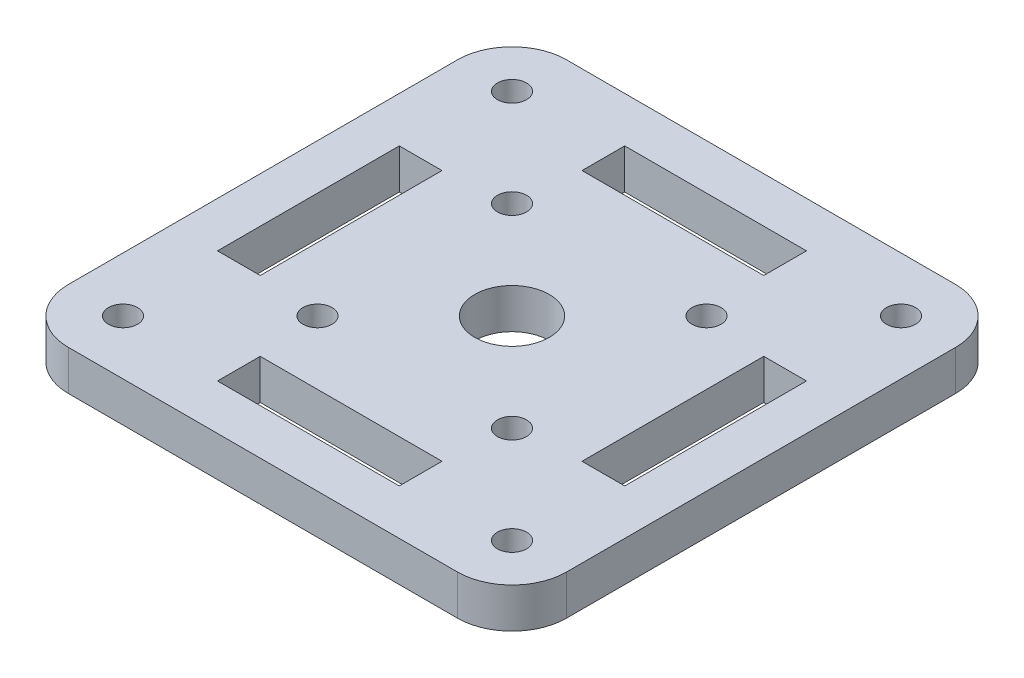
ISO-10303-21;
HEADER;
FILE_DESCRIPTION(('STEP AP214'),'2;1');
FILE_NAME('part.step','',(''),(''),'','','');
FILE_SCHEMA(('AUTOMOTIVE_DESIGN { 1 0 10303 214 1 1 1 1 }'));
ENDSEC;
DATA;
#1=APPLICATION_CONTEXT('core data for automotive mechanical design processes');
#2=APPLICATION_PROTOCOL_DEFINITION('international standard','automotive_design',2000,#1);
#3=PRODUCT_CONTEXT('',#1,'mechanical');
#4=PRODUCT('Part','Part','',(#3));
#5=PRODUCT_RELATED_PRODUCT_CATEGORY('part','',(#4));
#6=PRODUCT_DEFINITION_FORMATION('','',#4);
#7=PRODUCT_DEFINITION_CONTEXT('part definition',#1,'design');
#8=PRODUCT_DEFINITION('design','',#6,#7);
#9=PRODUCT_DEFINITION_SHAPE('','',#8);
#10=(LENGTH_UNIT() NAMED_UNIT(*) SI_UNIT(.MILLI.,.METRE.));
#11=(NAMED_UNIT(*) PLANE_ANGLE_UNIT() SI_UNIT($,.RADIAN.));
#12=(NAMED_UNIT(*) SI_UNIT($,.STERADIAN.) SOLID_ANGLE_UNIT());
#13=UNCERTAINTY_MEASURE_WITH_UNIT(LENGTH_MEASURE(1.E-05),#10,'distance_accuracy_value','');
#14=(GEOMETRIC_REPRESENTATION_CONTEXT(3) GLOBAL_UNCERTAINTY_ASSIGNED_CONTEXT((#13)) GLOBAL_UNIT_ASSIGNED_CONTEXT((#10,
#11,#12)) REPRESENTATION_CONTEXT('',''));
#15=CARTESIAN_POINT('',(0.,0.,0.));
#16=DIRECTION('',(0.,0.,1.));
#17=DIRECTION('',(1.,0.,0.));
#18=AXIS2_PLACEMENT_3D('',#15,#16,#17);
#19=CARTESIAN_POINT('',(0.,4.4,0.));
#20=DIRECTION('',(0.,1.,0.));
#21=DIRECTION('',(0.,0.,1.));
#22=AXIS2_PLACEMENT_3D('',#19,#20,#21);
#23=PLANE('',#22);
#24=CARTESIAN_POINT('',(10.7000000000006,4.4,10.7));
#25=DIRECTION('',(0.,1.,0.));
#26=DIRECTION('',(0.,0.,1.));
#27=AXIS2_PLACEMENT_3D('',#24,#25,#26);
#28=CIRCLE('',#27,1.59999999999985);
#29=CARTESIAN_POINT('',(10.7000000000006,4.4,12.2999999999999));
#30=VERTEX_POINT('',#29);
#31=EDGE_CURVE('E425',#30,#30,#28,.T.);
#32=ORIENTED_EDGE('',*,*,#31,.F.);
#33=EDGE_LOOP('',(#32));
#34=FACE_BOUND('',#33,.T.);
#35=CARTESIAN_POINT('',(-10.6999999999994,4.4,10.7000000000006));
#36=DIRECTION('',(0.,1.,0.));
#37=DIRECTION('',(0.,0.,1.));
#38=AXIS2_PLACEMENT_3D('',#35,#36,#37);
#39=CIRCLE('',#38,1.60000000000044);
#40=CARTESIAN_POINT('',(-10.6999999999994,4.4,12.3000000000011));
#41=VERTEX_POINT('',#40);
#42=EDGE_CURVE('E439',#41,#41,#39,.T.);
#43=ORIENTED_EDGE('',*,*,#42,.F.);
#44=EDGE_LOOP('',(#43));
#45=FACE_BOUND('',#44,.T.);
#46=CARTESIAN_POINT('',(-10.7,4.4,-10.6999999999994));
#47=DIRECTION('',(0.,1.,0.));
#48=DIRECTION('',(0.,0.,1.));
#49=AXIS2_PLACEMENT_3D('',#46,#47,#48);
#50=CIRCLE('',#49,1.60000000000064);
#51=CARTESIAN_POINT('',(-10.7,4.4,-9.09999999999877));
#52=VERTEX_POINT('',#51);
#53=EDGE_CURVE('E436',#52,#52,#50,.T.);
#54=ORIENTED_EDGE('',*,*,#53,.F.);
#55=EDGE_LOOP('',(#54));
#56=FACE_BOUND('',#55,.T.);
#57=CARTESIAN_POINT('',(10.7,4.4,-10.7));
#58=DIRECTION('',(0.,1.,0.));
#59=DIRECTION('',(0.,0.,1.));
#60=AXIS2_PLACEMENT_3D('',#57,#58,#59);
#61=CIRCLE('',#60,1.6);
#62=CARTESIAN_POINT('',(10.7,4.4,-9.10000000000004));
#63=VERTEX_POINT('',#62);
#64=EDGE_CURVE('E421',#63,#63,#61,.T.);
#65=ORIENTED_EDGE('',*,*,#64,.F.);
#66=EDGE_LOOP('',(#65));
#67=FACE_BOUND('',#66,.T.);
#68=CARTESIAN_POINT('',(-21.4,4.4,21.4000000000001));
#69=DIRECTION('',(0.,1.,0.));
#70=DIRECTION('',(0.,0.,1.));
#71=AXIS2_PLACEMENT_3D('',#68,#69,#70);
#72=CIRCLE('',#71,1.6);
#73=CARTESIAN_POINT('',(-21.4,4.4,23.0000000000001));
#74=VERTEX_POINT('',#73);
#75=EDGE_CURVE('E281',#74,#74,#72,.T.);
#76=ORIENTED_EDGE('',*,*,#75,.F.);
#77=EDGE_LOOP('',(#76));
#78=FACE_BOUND('',#77,.T.);
#79=CARTESIAN_POINT('',(21.4,4.4,-21.4000000000001));
#80=DIRECTION('',(0.,1.,0.));
#81=DIRECTION('',(0.,0.,1.));
#82=AXIS2_PLACEMENT_3D('',#79,#80,#81);
#83=CIRCLE('',#82,1.60000000000002);
#84=CARTESIAN_POINT('',(21.4,4.4,-19.8000000000001));
#85=VERTEX_POINT('',#84);
#86=EDGE_CURVE('E324',#85,#85,#83,.T.);
#87=ORIENTED_EDGE('',*,*,#86,.F.);
#88=EDGE_LOOP('',(#87));
#89=FACE_BOUND('',#88,.T.);
#90=DIRECTION('',(0.,0.,1.));
#91=VECTOR('',#90,1.);
#92=CARTESIAN_POINT('',(-27.4,4.4,-27.4000000000001));
#93=LINE('',#92,#91);
#94=CARTESIAN_POINT('',(-27.4,4.4,-21.4000000000001));
#95=VERTEX_POINT('',#94);
#96=CARTESIAN_POINT('',(-27.4,4.4,21.4000000000001));
#97=VERTEX_POINT('',#96);
#98=EDGE_CURVE('E373',#95,#97,#93,.T.);
#99=ORIENTED_EDGE('',*,*,#98,.T.);
#100=CARTESIAN_POINT('',(-21.4,4.4,21.4000000000001));
#101=DIRECTION('',(0.,1.,0.));
#102=DIRECTION('',(0.,0.,1.));
#103=AXIS2_PLACEMENT_3D('',#100,#101,#102);
#104=CIRCLE('',#103,6.);
#105=CARTESIAN_POINT('',(-21.4,4.4,27.4000000000001));
#106=VERTEX_POINT('',#105);
#107=EDGE_CURVE('E411',#97,#106,#104,.T.);
#108=ORIENTED_EDGE('',*,*,#107,.T.);
#109=DIRECTION('',(1.,0.,0.));
#110=VECTOR('',#109,1.);
#111=CARTESIAN_POINT('',(-27.4,4.4,27.4000000000001));
#112=LINE('',#111,#110);
#113=CARTESIAN_POINT('',(21.4,4.4,27.4000000000001));
#114=VERTEX_POINT('',#113);
#115=EDGE_CURVE('E376',#106,#114,#112,.T.);
#116=ORIENTED_EDGE('',*,*,#115,.T.);
#117=CARTESIAN_POINT('',(21.4,4.4,21.4000000000001));
#118=DIRECTION('',(0.,1.,0.));
#119=DIRECTION('',(0.,0.,1.));
#120=AXIS2_PLACEMENT_3D('',#117,#118,#119);
#121=CIRCLE('',#120,6.);
#122=CARTESIAN_POINT('',(27.4,4.4,21.4000000000001));
#123=VERTEX_POINT('',#122);
#124=EDGE_CURVE('E406',#114,#123,#121,.T.);
#125=ORIENTED_EDGE('',*,*,#124,.T.);
#126=DIRECTION('',(0.,0.,-1.));
#127=VECTOR('',#126,1.);
#128=CARTESIAN_POINT('',(27.4,4.4,-27.4000000000001));
#129=LINE('',#128,#127);
#130=CARTESIAN_POINT('',(27.4,4.4,-21.4000000000001));
#131=VERTEX_POINT('',#130);
#132=EDGE_CURVE('E368',#123,#131,#129,.T.);
#133=ORIENTED_EDGE('',*,*,#132,.T.);
#134=CARTESIAN_POINT('',(21.4,4.4,-21.4000000000001));
#135=DIRECTION('',(0.,1.,0.));
#136=DIRECTION('',(0.,0.,1.));
#137=AXIS2_PLACEMENT_3D('',#134,#135,#136);
#138=CIRCLE('',#137,6.);
#139=CARTESIAN_POINT('',(21.4,4.4,-27.4000000000001));
#140=VERTEX_POINT('',#139);
#141=EDGE_CURVE('E59',#131,#140,#138,.T.);
#142=ORIENTED_EDGE('',*,*,#141,.T.);
#143=DIRECTION('',(-1.,0.,0.));
#144=VECTOR('',#143,1.);
#145=CARTESIAN_POINT('',(-27.4,4.4,-27.4000000000001));
#146=LINE('',#145,#144);
#147=CARTESIAN_POINT('',(-21.4,4.4,-27.4000000000001));
#148=VERTEX_POINT('',#147);
#149=EDGE_CURVE('E370',#140,#148,#146,.T.);
#150=ORIENTED_EDGE('',*,*,#149,.T.);
#151=CARTESIAN_POINT('',(-21.4,4.4,-21.4000000000001));
#152=DIRECTION('',(0.,1.,0.));
#153=DIRECTION('',(0.,0.,1.));
#154=AXIS2_PLACEMENT_3D('',#151,#152,#153);
#155=CIRCLE('',#154,6.);
#156=EDGE_CURVE('E409',#148,#95,#155,.T.);
#157=ORIENTED_EDGE('',*,*,#156,.T.);
#158=EDGE_LOOP('',(#99,#108,#116,#125,#133,#142,#150,#157));
#159=FACE_BOUND('',#158,.T.);
#160=CARTESIAN_POINT('',(0.,4.4,0.));
#161=DIRECTION('',(0.,1.,0.));
#162=DIRECTION('',(0.,0.,1.));
#163=AXIS2_PLACEMENT_3D('',#160,#161,#162);
#164=CIRCLE('',#163,4.1);
#165=CARTESIAN_POINT('',(0.,4.4,4.1));
#166=VERTEX_POINT('',#165);
#167=EDGE_CURVE('E362',#166,#166,#164,.T.);
#168=ORIENTED_EDGE('',*,*,#167,.F.);
#169=EDGE_LOOP('',(#168));
#170=FACE_BOUND('',#169,.T.);
#171=DIRECTION('',(0.,0.,-1.));
#172=VECTOR('',#171,1.);
#173=CARTESIAN_POINT('',(22.4,4.4,10.));
#174=LINE('',#173,#172);
#175=CARTESIAN_POINT('',(22.4,4.4,10.));
#176=VERTEX_POINT('',#175);
#177=CARTESIAN_POINT('',(22.4,4.4,-10.));
#178=VERTEX_POINT('',#177);
#179=EDGE_CURVE('E332',#176,#178,#174,.T.);
#180=ORIENTED_EDGE('',*,*,#179,.F.);
#181=DIRECTION('',(1.,0.,0.));
#182=VECTOR('',#181,1.);
#183=CARTESIAN_POINT('',(17.7,4.4,10.));
#184=LINE('',#183,#182);
#185=CARTESIAN_POINT('',(17.7,4.4,10.));
#186=VERTEX_POINT('',#185);
#187=EDGE_CURVE('E330',#186,#176,#184,.T.);
#188=ORIENTED_EDGE('',*,*,#187,.F.);
#189=DIRECTION('',(0.,0.,1.));
#190=VECTOR('',#189,1.);
#191=CARTESIAN_POINT('',(17.7,4.4,-5.));
#192=LINE('',#191,#190);
#193=CARTESIAN_POINT('',(17.7,4.4,-10.));
#194=VERTEX_POINT('',#193);
#195=EDGE_CURVE('E338',#194,#186,#192,.T.);
#196=ORIENTED_EDGE('',*,*,#195,.F.);
#197=DIRECTION('',(-1.,0.,0.));
#198=VECTOR('',#197,1.);
#199=CARTESIAN_POINT('',(17.7,4.4,-10.));
#200=LINE('',#199,#198);
#201=EDGE_CURVE('E335',#178,#194,#200,.T.);
#202=ORIENTED_EDGE('',*,*,#201,.F.);
#203=EDGE_LOOP('',(#180,#188,#196,#202));
#204=FACE_BOUND('',#203,.T.);
#205=CARTESIAN_POINT('',(21.4,4.4,21.4000000000001));
#206=DIRECTION('',(0.,1.,0.));
#207=DIRECTION('',(0.,0.,-1.));
#208=AXIS2_PLACEMENT_3D('',#205,#206,#207);
#209=CIRCLE('',#208,1.6);
#210=CARTESIAN_POINT('',(21.4,4.4,19.8000000000001));
#211=VERTEX_POINT('',#210);
#212=EDGE_CURVE('E318',#211,#211,#209,.T.);
#213=ORIENTED_EDGE('',*,*,#212,.F.);
#214=EDGE_LOOP('',(#213));
#215=FACE_BOUND('',#214,.T.);
#216=DIRECTION('',(-1.,0.,0.));
#217=VECTOR('',#216,1.);
#218=CARTESIAN_POINT('',(9.99999999999992,4.4,-22.4));
#219=LINE('',#218,#217);
#220=CARTESIAN_POINT('',(9.99999999999992,4.4,-22.4));
#221=VERTEX_POINT('',#220);
#222=CARTESIAN_POINT('',(-10.0000000000001,4.4,-22.3999999999999));
#223=VERTEX_POINT('',#222);
#224=EDGE_CURVE('E292',#221,#223,#219,.T.);
#225=ORIENTED_EDGE('',*,*,#224,.F.);
#226=DIRECTION('',(0.,0.,-1.));
#227=VECTOR('',#226,1.);
#228=CARTESIAN_POINT('',(9.99999999999993,4.4,-17.7));
#229=LINE('',#228,#227);
#230=CARTESIAN_POINT('',(9.99999999999993,4.4,-17.7));
#231=VERTEX_POINT('',#230);
#232=EDGE_CURVE('E289',#231,#221,#229,.T.);
#233=ORIENTED_EDGE('',*,*,#232,.F.);
#234=DIRECTION('',(1.,0.,0.));
#235=VECTOR('',#234,1.);
#236=CARTESIAN_POINT('',(-5.00000000000006,4.4,-17.7));
#237=LINE('',#236,#235);
#238=CARTESIAN_POINT('',(-10.0000000000001,4.4,-17.6999999999999));
#239=VERTEX_POINT('',#238);
#240=EDGE_CURVE('E287',#239,#231,#237,.T.);
#241=ORIENTED_EDGE('',*,*,#240,.F.);
#242=DIRECTION('',(0.,0.,1.));
#243=VECTOR('',#242,1.);
#244=CARTESIAN_POINT('',(-10.0000000000001,4.4,-17.6999999999999));
#245=LINE('',#244,#243);
#246=EDGE_CURVE('E294',#223,#239,#245,.T.);
#247=ORIENTED_EDGE('',*,*,#246,.F.);
#248=EDGE_LOOP('',(#225,#233,#241,#247));
#249=FACE_BOUND('',#248,.T.);
#250=CARTESIAN_POINT('',(-21.4,4.4,-21.4000000000001));
#251=DIRECTION('',(0.,1.,0.));
#252=DIRECTION('',(0.,0.,-1.));
#253=AXIS2_PLACEMENT_3D('',#250,#251,#252);
#254=CIRCLE('',#253,1.6);
#255=CARTESIAN_POINT('',(-21.4,4.4,-23.0000000000001));
#256=VERTEX_POINT('',#255);
#257=EDGE_CURVE('E275',#256,#256,#254,.T.);
#258=ORIENTED_EDGE('',*,*,#257,.F.);
#259=EDGE_LOOP('',(#258));
#260=FACE_BOUND('',#259,.T.);
#261=DIRECTION('',(1.,0.,0.));
#262=VECTOR('',#261,1.);
#263=CARTESIAN_POINT('',(-10.0000000000001,4.4,22.3999999999999));
#264=LINE('',#263,#262);
#265=CARTESIAN_POINT('',(-10.0000000000001,4.4,22.3999999999999));
#266=VERTEX_POINT('',#265);
#267=CARTESIAN_POINT('',(9.99999999999992,4.4,22.4));
#268=VERTEX_POINT('',#267);
#269=EDGE_CURVE('E249',#266,#268,#264,.T.);
#270=ORIENTED_EDGE('',*,*,#269,.F.);
#271=DIRECTION('',(0.,0.,1.));
#272=VECTOR('',#271,1.);
#273=CARTESIAN_POINT('',(-10.0000000000001,4.4,17.6999999999999));
#274=LINE('',#273,#272);
#275=CARTESIAN_POINT('',(-10.0000000000001,4.4,17.6999999999999));
#276=VERTEX_POINT('',#275);
#277=EDGE_CURVE('E246',#276,#266,#274,.T.);
#278=ORIENTED_EDGE('',*,*,#277,.F.);
#279=DIRECTION('',(-1.,0.,0.));
#280=VECTOR('',#279,1.);
#281=CARTESIAN_POINT('',(4.99999999999994,4.4,17.7));
#282=LINE('',#281,#280);
#283=CARTESIAN_POINT('',(9.99999999999993,4.4,17.7));
#284=VERTEX_POINT('',#283);
#285=EDGE_CURVE('E244',#284,#276,#282,.T.);
#286=ORIENTED_EDGE('',*,*,#285,.F.);
#287=DIRECTION('',(0.,0.,-1.));
#288=VECTOR('',#287,1.);
#289=CARTESIAN_POINT('',(9.99999999999993,4.4,17.7));
#290=LINE('',#289,#288);
#291=EDGE_CURVE('E251',#268,#284,#290,.T.);
#292=ORIENTED_EDGE('',*,*,#291,.F.);
#293=EDGE_LOOP('',(#270,#278,#286,#292));
#294=FACE_BOUND('',#293,.T.);
#295=DIRECTION('',(-1.,0.,0.));
#296=VECTOR('',#295,1.);
#297=CARTESIAN_POINT('',(-17.6999999999999,4.4,-10.0000000000001));
#298=LINE('',#297,#296);
#299=CARTESIAN_POINT('',(-17.6999999999999,4.4,-10.0000000000001));
#300=VERTEX_POINT('',#299);
#301=CARTESIAN_POINT('',(-22.3999999999999,4.4,-10.0000000000002));
#302=VERTEX_POINT('',#301);
#303=EDGE_CURVE('E209',#300,#302,#298,.T.);
#304=ORIENTED_EDGE('',*,*,#303,.F.);
#305=DIRECTION('',(0.,0.,-1.));
#306=VECTOR('',#305,1.);
#307=CARTESIAN_POINT('',(-17.7,4.4,4.99999999999986));
#308=LINE('',#307,#306);
#309=CARTESIAN_POINT('',(-17.7000000000001,4.4,9.99999999999986));
#310=VERTEX_POINT('',#309);
#311=EDGE_CURVE('E199',#310,#300,#308,.T.);
#312=ORIENTED_EDGE('',*,*,#311,.F.);
#313=DIRECTION('',(1.,0.,0.));
#314=VECTOR('',#313,1.);
#315=CARTESIAN_POINT('',(-17.7000000000001,4.4,9.99999999999986));
#316=LINE('',#315,#314);
#317=CARTESIAN_POINT('',(-22.4000000000001,4.4,9.99999999999983));
#318=VERTEX_POINT('',#317);
#319=EDGE_CURVE('E226',#318,#310,#316,.T.);
#320=ORIENTED_EDGE('',*,*,#319,.F.);
#321=DIRECTION('',(0.,0.,1.));
#322=VECTOR('',#321,1.);
#323=CARTESIAN_POINT('',(-22.3999999999999,4.4,-10.0000000000002));
#324=LINE('',#323,#322);
#325=EDGE_CURVE('E224',#302,#318,#324,.T.);
#326=ORIENTED_EDGE('',*,*,#325,.F.);
#327=EDGE_LOOP('',(#304,#312,#320,#326));
#328=FACE_BOUND('',#327,.T.);
#329=ADVANCED_FACE('F35',(#34,#45,#56,#67,#78,#89,#159,#170,#204,#215,#249,#260,#294,#328),#23,.T.);
#330=CARTESIAN_POINT('',(0.,0.,0.));
#331=DIRECTION('',(0.,1.,0.));
#332=DIRECTION('',(0.,0.,1.));
#333=AXIS2_PLACEMENT_3D('',#330,#331,#332);
#334=PLANE('',#333);
#335=CARTESIAN_POINT('',(10.7000000000006,0.,10.7));
#336=DIRECTION('',(0.,1.,0.));
#337=DIRECTION('',(0.,0.,1.));
#338=AXIS2_PLACEMENT_3D('',#335,#336,#337);
#339=CIRCLE('',#338,1.59999999999985);
#340=CARTESIAN_POINT('',(10.7000000000006,0.,12.2999999999999));
#341=VERTEX_POINT('',#340);
#342=EDGE_CURVE('E39',#341,#341,#339,.T.);
#343=ORIENTED_EDGE('',*,*,#342,.T.);
#344=EDGE_LOOP('',(#343));
#345=FACE_BOUND('',#344,.T.);
#346=CARTESIAN_POINT('',(-10.6999999999994,0.,10.7000000000006));
#347=DIRECTION('',(0.,1.,0.));
#348=DIRECTION('',(0.,0.,1.));
#349=AXIS2_PLACEMENT_3D('',#346,#347,#348);
#350=CIRCLE('',#349,1.60000000000044);
#351=CARTESIAN_POINT('',(-10.6999999999994,0.,12.3000000000011));
#352=VERTEX_POINT('',#351);
#353=EDGE_CURVE('E424',#352,#352,#350,.T.);
#354=ORIENTED_EDGE('',*,*,#353,.T.);
#355=EDGE_LOOP('',(#354));
#356=FACE_BOUND('',#355,.T.);
#357=CARTESIAN_POINT('',(-10.7,0.,-10.6999999999994));
#358=DIRECTION('',(0.,1.,0.));
#359=DIRECTION('',(0.,0.,1.));
#360=AXIS2_PLACEMENT_3D('',#357,#358,#359);
#361=CIRCLE('',#360,1.60000000000064);
#362=CARTESIAN_POINT('',(-10.7,0.,-9.09999999999877));
#363=VERTEX_POINT('',#362);
#364=EDGE_CURVE('E422',#363,#363,#361,.T.);
#365=ORIENTED_EDGE('',*,*,#364,.T.);
#366=EDGE_LOOP('',(#365));
#367=FACE_BOUND('',#366,.T.);
#368=CARTESIAN_POINT('',(10.7,0.,-10.7));
#369=DIRECTION('',(0.,1.,0.));
#370=DIRECTION('',(0.,0.,1.));
#371=AXIS2_PLACEMENT_3D('',#368,#369,#370);
#372=CIRCLE('',#371,1.6);
#373=CARTESIAN_POINT('',(10.7,0.,-9.10000000000004));
#374=VERTEX_POINT('',#373);
#375=EDGE_CURVE('E233',#374,#374,#372,.T.);
#376=ORIENTED_EDGE('',*,*,#375,.T.);
#377=EDGE_LOOP('',(#376));
#378=FACE_BOUND('',#377,.T.);
#379=DIRECTION('',(0.,0.,1.));
#380=VECTOR('',#379,1.);
#381=CARTESIAN_POINT('',(-10.0000000000001,0.,17.6999999999999));
#382=LINE('',#381,#380);
#383=CARTESIAN_POINT('',(-10.0000000000001,0.,17.7));
#384=VERTEX_POINT('',#383);
#385=CARTESIAN_POINT('',(-10.0000000000001,0.,22.3999999999999));
#386=VERTEX_POINT('',#385);
#387=EDGE_CURVE('E219',#384,#386,#382,.T.);
#388=ORIENTED_EDGE('',*,*,#387,.T.);
#389=DIRECTION('',(1.,0.,0.));
#390=VECTOR('',#389,1.);
#391=CARTESIAN_POINT('',(9.99999999999992,0.,22.4));
#392=LINE('',#391,#390);
#393=CARTESIAN_POINT('',(9.99999999999992,0.,22.4));
#394=VERTEX_POINT('',#393);
#395=EDGE_CURVE('E257',#386,#394,#392,.T.);
#396=ORIENTED_EDGE('',*,*,#395,.T.);
#397=DIRECTION('',(0.,0.,-1.));
#398=VECTOR('',#397,1.);
#399=CARTESIAN_POINT('',(9.99999999999993,0.,17.7));
#400=LINE('',#399,#398);
#401=CARTESIAN_POINT('',(9.99999999999993,0.,17.7));
#402=VERTEX_POINT('',#401);
#403=EDGE_CURVE('E260',#394,#402,#400,.T.);
#404=ORIENTED_EDGE('',*,*,#403,.T.);
#405=DIRECTION('',(-1.,0.,0.));
#406=VECTOR('',#405,1.);
#407=CARTESIAN_POINT('',(4.99999999999994,0.,17.7));
#408=LINE('',#407,#406);
#409=EDGE_CURVE('E247',#402,#384,#408,.T.);
#410=ORIENTED_EDGE('',*,*,#409,.T.);
#411=EDGE_LOOP('',(#388,#396,#404,#410));
#412=FACE_BOUND('',#411,.T.);
#413=CARTESIAN_POINT('',(21.4,0.,21.4000000000001));
#414=DIRECTION('',(0.,1.,0.));
#415=DIRECTION('',(0.,0.,-1.));
#416=AXIS2_PLACEMENT_3D('',#413,#414,#415);
#417=CIRCLE('',#416,1.6);
#418=CARTESIAN_POINT('',(21.4,0.,19.8000000000001));
#419=VERTEX_POINT('',#418);
#420=EDGE_CURVE('E317',#419,#419,#417,.T.);
#421=ORIENTED_EDGE('',*,*,#420,.T.);
#422=EDGE_LOOP('',(#421));
#423=FACE_BOUND('',#422,.T.);
#424=CARTESIAN_POINT('',(21.4,0.,-21.4000000000001));
#425=DIRECTION('',(0.,1.,0.));
#426=DIRECTION('',(0.,0.,1.));
#427=AXIS2_PLACEMENT_3D('',#424,#425,#426);
#428=CIRCLE('',#427,1.60000000000002);
#429=CARTESIAN_POINT('',(21.4,0.,-19.8000000000001));
#430=VERTEX_POINT('',#429);
#431=EDGE_CURVE('E321',#430,#430,#428,.T.);
#432=ORIENTED_EDGE('',*,*,#431,.T.);
#433=EDGE_LOOP('',(#432));
#434=FACE_BOUND('',#433,.T.);
#435=DIRECTION('',(1.,0.,0.));
#436=VECTOR('',#435,1.);
#437=CARTESIAN_POINT('',(17.7,0.,10.));
#438=LINE('',#437,#436);
#439=CARTESIAN_POINT('',(17.7,0.,10.));
#440=VERTEX_POINT('',#439);
#441=CARTESIAN_POINT('',(22.4,0.,10.));
#442=VERTEX_POINT('',#441);
#443=EDGE_CURVE('E327',#440,#442,#438,.T.);
#444=ORIENTED_EDGE('',*,*,#443,.T.);
#445=DIRECTION('',(0.,0.,-1.));
#446=VECTOR('',#445,1.);
#447=CARTESIAN_POINT('',(22.4,0.,-10.));
#448=LINE('',#447,#446);
#449=CARTESIAN_POINT('',(22.4,0.,-10.));
#450=VERTEX_POINT('',#449);
#451=EDGE_CURVE('E343',#442,#450,#448,.T.);
#452=ORIENTED_EDGE('',*,*,#451,.T.);
#453=DIRECTION('',(-1.,0.,0.));
#454=VECTOR('',#453,1.);
#455=CARTESIAN_POINT('',(17.7,0.,-10.));
#456=LINE('',#455,#454);
#457=CARTESIAN_POINT('',(17.7,0.,-10.));
#458=VERTEX_POINT('',#457);
#459=EDGE_CURVE('E346',#450,#458,#456,.T.);
#460=ORIENTED_EDGE('',*,*,#459,.T.);
#461=DIRECTION('',(0.,0.,1.));
#462=VECTOR('',#461,1.);
#463=CARTESIAN_POINT('',(17.7,0.,5.));
#464=LINE('',#463,#462);
#465=EDGE_CURVE('E333',#458,#440,#464,.T.);
#466=ORIENTED_EDGE('',*,*,#465,.T.);
#467=EDGE_LOOP('',(#444,#452,#460,#466));
#468=FACE_BOUND('',#467,.T.);
#469=DIRECTION('',(1.,0.,0.));
#470=VECTOR('',#469,1.);
#471=CARTESIAN_POINT('',(-27.4,0.,27.4000000000001));
#472=LINE('',#471,#470);
#473=CARTESIAN_POINT('',(-21.4,0.,27.4000000000001));
#474=VERTEX_POINT('',#473);
#475=CARTESIAN_POINT('',(21.4,0.,27.4000000000001));
#476=VERTEX_POINT('',#475);
#477=EDGE_CURVE('E371',#474,#476,#472,.T.);
#478=ORIENTED_EDGE('',*,*,#477,.F.);
#479=CARTESIAN_POINT('',(-21.4,0.,21.4000000000001));
#480=DIRECTION('',(0.,1.,0.));
#481=DIRECTION('',(0.,0.,1.));
#482=AXIS2_PLACEMENT_3D('',#479,#480,#481);
#483=CIRCLE('',#482,6.);
#484=CARTESIAN_POINT('',(-27.4,0.,21.4000000000001));
#485=VERTEX_POINT('',#484);
#486=EDGE_CURVE('E399',#474,#485,#483,.F.);
#487=ORIENTED_EDGE('',*,*,#486,.T.);
#488=DIRECTION('',(0.,0.,1.));
#489=VECTOR('',#488,1.);
#490=CARTESIAN_POINT('',(-27.4,0.,-27.4000000000001));
#491=LINE('',#490,#489);
#492=CARTESIAN_POINT('',(-27.4,0.,-21.4000000000001));
#493=VERTEX_POINT('',#492);
#494=EDGE_CURVE('E384',#493,#485,#491,.T.);
#495=ORIENTED_EDGE('',*,*,#494,.F.);
#496=CARTESIAN_POINT('',(-21.4,0.,-21.4000000000001));
#497=DIRECTION('',(0.,1.,0.));
#498=DIRECTION('',(0.,0.,1.));
#499=AXIS2_PLACEMENT_3D('',#496,#497,#498);
#500=CIRCLE('',#499,6.);
#501=CARTESIAN_POINT('',(-21.4,0.,-27.4000000000001));
#502=VERTEX_POINT('',#501);
#503=EDGE_CURVE('E397',#493,#502,#500,.F.);
#504=ORIENTED_EDGE('',*,*,#503,.T.);
#505=DIRECTION('',(-1.,0.,0.));
#506=VECTOR('',#505,1.);
#507=CARTESIAN_POINT('',(-27.4,0.,-27.4000000000001));
#508=LINE('',#507,#506);
#509=CARTESIAN_POINT('',(21.4,0.,-27.4000000000001));
#510=VERTEX_POINT('',#509);
#511=EDGE_CURVE('E382',#510,#502,#508,.T.);
#512=ORIENTED_EDGE('',*,*,#511,.F.);
#513=CARTESIAN_POINT('',(21.4,0.,-21.4000000000001));
#514=DIRECTION('',(0.,1.,0.));
#515=DIRECTION('',(0.,0.,1.));
#516=AXIS2_PLACEMENT_3D('',#513,#514,#515);
#517=CIRCLE('',#516,6.);
#518=CARTESIAN_POINT('',(27.4,0.,-21.4000000000001));
#519=VERTEX_POINT('',#518);
#520=EDGE_CURVE('E395',#510,#519,#517,.F.);
#521=ORIENTED_EDGE('',*,*,#520,.T.);
#522=DIRECTION('',(0.,0.,-1.));
#523=VECTOR('',#522,1.);
#524=CARTESIAN_POINT('',(27.4,0.,-27.4000000000001));
#525=LINE('',#524,#523);
#526=CARTESIAN_POINT('',(27.4,0.,21.4000000000001));
#527=VERTEX_POINT('',#526);
#528=EDGE_CURVE('E365',#527,#519,#525,.T.);
#529=ORIENTED_EDGE('',*,*,#528,.F.);
#530=CARTESIAN_POINT('',(21.4,0.,21.4000000000001));
#531=DIRECTION('',(0.,1.,0.));
#532=DIRECTION('',(0.,0.,1.));
#533=AXIS2_PLACEMENT_3D('',#530,#531,#532);
#534=CIRCLE('',#533,6.);
#535=EDGE_CURVE('E393',#527,#476,#534,.F.);
#536=ORIENTED_EDGE('',*,*,#535,.T.);
#537=EDGE_LOOP('',(#478,#487,#495,#504,#512,#521,#529,#536));
#538=FACE_BOUND('',#537,.T.);
#539=CARTESIAN_POINT('',(0.,0.,0.));
#540=DIRECTION('',(0.,1.,0.));
#541=DIRECTION('',(0.,0.,1.));
#542=AXIS2_PLACEMENT_3D('',#539,#540,#541);
#543=CIRCLE('',#542,4.1);
#544=CARTESIAN_POINT('',(0.,0.,4.1));
#545=VERTEX_POINT('',#544);
#546=EDGE_CURVE('E361',#545,#545,#543,.T.);
#547=ORIENTED_EDGE('',*,*,#546,.T.);
#548=EDGE_LOOP('',(#547));
#549=FACE_BOUND('',#548,.T.);
#550=DIRECTION('',(0.,0.,-1.));
#551=VECTOR('',#550,1.);
#552=CARTESIAN_POINT('',(9.99999999999993,0.,-17.7));
#553=LINE('',#552,#551);
#554=CARTESIAN_POINT('',(9.99999999999993,0.,-17.7000000000001));
#555=VERTEX_POINT('',#554);
#556=CARTESIAN_POINT('',(9.99999999999992,0.,-22.4));
#557=VERTEX_POINT('',#556);
#558=EDGE_CURVE('E284',#555,#557,#553,.T.);
#559=ORIENTED_EDGE('',*,*,#558,.T.);
#560=DIRECTION('',(-1.,0.,0.));
#561=VECTOR('',#560,1.);
#562=CARTESIAN_POINT('',(-10.0000000000001,0.,-22.3999999999999));
#563=LINE('',#562,#561);
#564=CARTESIAN_POINT('',(-10.0000000000001,0.,-22.3999999999999));
#565=VERTEX_POINT('',#564);
#566=EDGE_CURVE('E300',#557,#565,#563,.T.);
#567=ORIENTED_EDGE('',*,*,#566,.T.);
#568=DIRECTION('',(0.,0.,1.));
#569=VECTOR('',#568,1.);
#570=CARTESIAN_POINT('',(-10.0000000000001,0.,-17.6999999999999));
#571=LINE('',#570,#569);
#572=CARTESIAN_POINT('',(-10.0000000000001,0.,-17.6999999999999));
#573=VERTEX_POINT('',#572);
#574=EDGE_CURVE('E303',#565,#573,#571,.T.);
#575=ORIENTED_EDGE('',*,*,#574,.T.);
#576=DIRECTION('',(1.,0.,0.));
#577=VECTOR('',#576,1.);
#578=CARTESIAN_POINT('',(-5.00000000000006,0.,-17.7));
#579=LINE('',#578,#577);
#580=EDGE_CURVE('E290',#573,#555,#579,.T.);
#581=ORIENTED_EDGE('',*,*,#580,.T.);
#582=EDGE_LOOP('',(#559,#567,#575,#581));
#583=FACE_BOUND('',#582,.T.);
#584=CARTESIAN_POINT('',(-21.4,0.,21.4000000000001));
#585=DIRECTION('',(0.,1.,0.));
#586=DIRECTION('',(0.,0.,1.));
#587=AXIS2_PLACEMENT_3D('',#584,#585,#586);
#588=CIRCLE('',#587,1.6);
#589=CARTESIAN_POINT('',(-21.4,0.,23.0000000000001));
#590=VERTEX_POINT('',#589);
#591=EDGE_CURVE('E278',#590,#590,#588,.T.);
#592=ORIENTED_EDGE('',*,*,#591,.T.);
#593=EDGE_LOOP('',(#592));
#594=FACE_BOUND('',#593,.T.);
#595=CARTESIAN_POINT('',(-21.4,0.,-21.4000000000001));
#596=DIRECTION('',(0.,1.,0.));
#597=DIRECTION('',(0.,0.,-1.));
#598=AXIS2_PLACEMENT_3D('',#595,#596,#597);
#599=CIRCLE('',#598,1.6);
#600=CARTESIAN_POINT('',(-21.4,0.,-23.0000000000001));
#601=VERTEX_POINT('',#600);
#602=EDGE_CURVE('E274',#601,#601,#599,.T.);
#603=ORIENTED_EDGE('',*,*,#602,.T.);
#604=EDGE_LOOP('',(#603));
#605=FACE_BOUND('',#604,.T.);
#606=DIRECTION('',(0.,0.,-1.));
#607=VECTOR('',#606,1.);
#608=CARTESIAN_POINT('',(-17.6999999999999,0.,-5.00000000000013));
#609=LINE('',#608,#607);
#610=CARTESIAN_POINT('',(-17.7000000000001,0.,9.99999999999986));
#611=VERTEX_POINT('',#610);
#612=CARTESIAN_POINT('',(-17.6999999999999,0.,-10.0000000000001));
#613=VERTEX_POINT('',#612);
#614=EDGE_CURVE('E231',#611,#613,#609,.T.);
#615=ORIENTED_EDGE('',*,*,#614,.T.);
#616=DIRECTION('',(-1.,0.,0.));
#617=VECTOR('',#616,1.);
#618=CARTESIAN_POINT('',(-17.6999999999999,0.,-10.0000000000001));
#619=LINE('',#618,#617);
#620=CARTESIAN_POINT('',(-22.3999999999999,0.,-10.0000000000002));
#621=VERTEX_POINT('',#620);
#622=EDGE_CURVE('E217',#613,#621,#619,.T.);
#623=ORIENTED_EDGE('',*,*,#622,.T.);
#624=DIRECTION('',(0.,0.,1.));
#625=VECTOR('',#624,1.);
#626=CARTESIAN_POINT('',(-22.4000000000001,0.,9.99999999999983));
#627=LINE('',#626,#625);
#628=CARTESIAN_POINT('',(-22.4000000000001,0.,9.99999999999983));
#629=VERTEX_POINT('',#628);
#630=EDGE_CURVE('E235',#621,#629,#627,.T.);
#631=ORIENTED_EDGE('',*,*,#630,.T.);
#632=DIRECTION('',(1.,0.,0.));
#633=VECTOR('',#632,1.);
#634=CARTESIAN_POINT('',(-17.7000000000001,0.,9.99999999999986));
#635=LINE('',#634,#633);
#636=EDGE_CURVE('E210',#629,#611,#635,.T.);
#637=ORIENTED_EDGE('',*,*,#636,.T.);
#638=EDGE_LOOP('',(#615,#623,#631,#637));
#639=FACE_BOUND('',#638,.T.);
#640=ADVANCED_FACE('F450',(#345,#356,#367,#378,#412,#423,#434,#468,#538,#549,#583,#594,#605,
#639),#334,.F.);
#641=CARTESIAN_POINT('',(27.4,4.4,-27.4000000000001));
#642=DIRECTION('',(-1.,0.,0.));
#643=DIRECTION('',(0.,0.,1.));
#644=AXIS2_PLACEMENT_3D('',#641,#642,#643);
#645=PLANE('',#644);
#646=ORIENTED_EDGE('',*,*,#528,.T.);
#647=DIRECTION('',(0.,-1.,0.));
#648=VECTOR('',#647,1.);
#649=CARTESIAN_POINT('',(27.4,4.4,-21.4000000000001));
#650=LINE('',#649,#648);
#651=EDGE_CURVE('E11',#519,#131,#650,.F.);
#652=ORIENTED_EDGE('',*,*,#651,.T.);
#653=ORIENTED_EDGE('',*,*,#132,.F.);
#654=DIRECTION('',(0.,-1.,0.));
#655=VECTOR('',#654,1.);
#656=CARTESIAN_POINT('',(27.4,4.4,21.4000000000001));
#657=LINE('',#656,#655);
#658=EDGE_CURVE('E44',#123,#527,#657,.T.);
#659=ORIENTED_EDGE('',*,*,#658,.T.);
#660=EDGE_LOOP('',(#646,#652,#653,#659));
#661=FACE_BOUND('',#660,.T.);
#662=ADVANCED_FACE('F565',(#661),#645,.F.);
#663=CARTESIAN_POINT('',(-27.4,4.4,-27.4000000000001));
#664=DIRECTION('',(0.,0.,1.));
#665=DIRECTION('',(1.,0.,0.));
#666=AXIS2_PLACEMENT_3D('',#663,#664,#665);
#667=PLANE('',#666);
#668=ORIENTED_EDGE('',*,*,#511,.T.);
#669=DIRECTION('',(0.,-1.,0.));
#670=VECTOR('',#669,1.);
#671=CARTESIAN_POINT('',(-21.4,4.4,-27.4000000000001));
#672=LINE('',#671,#670);
#673=EDGE_CURVE('E52',#502,#148,#672,.F.);
#674=ORIENTED_EDGE('',*,*,#673,.T.);
#675=ORIENTED_EDGE('',*,*,#149,.F.);
#676=DIRECTION('',(0.,-1.,0.));
#677=VECTOR('',#676,1.);
#678=CARTESIAN_POINT('',(21.4,4.4,-27.4000000000001));
#679=LINE('',#678,#677);
#680=EDGE_CURVE('E413',#140,#510,#679,.T.);
#681=ORIENTED_EDGE('',*,*,#680,.T.);
#682=EDGE_LOOP('',(#668,#674,#675,#681));
#683=FACE_BOUND('',#682,.T.);
#684=ADVANCED_FACE('F572',(#683),#667,.F.);
#685=CARTESIAN_POINT('',(-27.4,4.4,-27.4000000000001));
#686=DIRECTION('',(1.,0.,0.));
#687=DIRECTION('',(0.,0.,-1.));
#688=AXIS2_PLACEMENT_3D('',#685,#686,#687);
#689=PLANE('',#688);
#690=ORIENTED_EDGE('',*,*,#494,.T.);
#691=DIRECTION('',(0.,-1.,0.));
#692=VECTOR('',#691,1.);
#693=CARTESIAN_POINT('',(-27.4,4.4,21.4000000000001));
#694=LINE('',#693,#692);
#695=EDGE_CURVE('E404',#485,#97,#694,.F.);
#696=ORIENTED_EDGE('',*,*,#695,.T.);
#697=ORIENTED_EDGE('',*,*,#98,.F.);
#698=DIRECTION('',(0.,-1.,0.));
#699=VECTOR('',#698,1.);
#700=CARTESIAN_POINT('',(-27.4,4.4,-21.4000000000001));
#701=LINE('',#700,#699);
#702=EDGE_CURVE('E401',#95,#493,#701,.T.);
#703=ORIENTED_EDGE('',*,*,#702,.T.);
#704=EDGE_LOOP('',(#690,#696,#697,#703));
#705=FACE_BOUND('',#704,.T.);
#706=ADVANCED_FACE('F568',(#705),#689,.F.);
#707=CARTESIAN_POINT('',(-27.4,4.4,27.4000000000001));
#708=DIRECTION('',(0.,0.,-1.));
#709=DIRECTION('',(-1.,0.,0.));
#710=AXIS2_PLACEMENT_3D('',#707,#708,#709);
#711=PLANE('',#710);
#712=ORIENTED_EDGE('',*,*,#115,.F.);
#713=DIRECTION('',(0.,-1.,0.));
#714=VECTOR('',#713,1.);
#715=CARTESIAN_POINT('',(-21.4,4.4,27.4000000000001));
#716=LINE('',#715,#714);
#717=EDGE_CURVE('E390',#106,#474,#716,.T.);
#718=ORIENTED_EDGE('',*,*,#717,.T.);
#719=ORIENTED_EDGE('',*,*,#477,.T.);
#720=DIRECTION('',(0.,-1.,0.));
#721=VECTOR('',#720,1.);
#722=CARTESIAN_POINT('',(21.4,4.4,27.4000000000001));
#723=LINE('',#722,#721);
#724=EDGE_CURVE('E379',#476,#114,#723,.F.);
#725=ORIENTED_EDGE('',*,*,#724,.T.);
#726=EDGE_LOOP('',(#712,#718,#719,#725));
#727=FACE_BOUND('',#726,.T.);
#728=ADVANCED_FACE('F560',(#727),#711,.F.);
#729=CARTESIAN_POINT('',(0.,4.4,0.));
#730=DIRECTION('',(0.,-1.,0.));
#731=DIRECTION('',(0.,0.,-1.));
#732=AXIS2_PLACEMENT_3D('',#729,#730,#731);
#733=CYLINDRICAL_SURFACE('',#732,4.1);
#734=ORIENTED_EDGE('',*,*,#167,.T.);
#735=EDGE_LOOP('',(#734));
#736=FACE_BOUND('',#735,.T.);
#737=ORIENTED_EDGE('',*,*,#546,.F.);
#738=EDGE_LOOP('',(#737));
#739=FACE_BOUND('',#738,.T.);
#740=ADVANCED_FACE('F557',(#736,#739),#733,.F.);
#741=CARTESIAN_POINT('',(17.7,4.4,10.));
#742=DIRECTION('',(0.,0.,-1.));
#743=DIRECTION('',(-1.,0.,0.));
#744=AXIS2_PLACEMENT_3D('',#741,#742,#743);
#745=PLANE('',#744);
#746=ORIENTED_EDGE('',*,*,#443,.F.);
#747=DIRECTION('',(0.,-1.,0.));
#748=VECTOR('',#747,1.);
#749=CARTESIAN_POINT('',(17.7,4.4,10.));
#750=LINE('',#749,#748);
#751=EDGE_CURVE('E340',#186,#440,#750,.T.);
#752=ORIENTED_EDGE('',*,*,#751,.F.);
#753=ORIENTED_EDGE('',*,*,#187,.T.);
#754=DIRECTION('',(0.,-1.,0.));
#755=VECTOR('',#754,1.);
#756=CARTESIAN_POINT('',(22.4,4.4,10.));
#757=LINE('',#756,#755);
#758=EDGE_CURVE('E358',#176,#442,#757,.T.);
#759=ORIENTED_EDGE('',*,*,#758,.T.);
#760=EDGE_LOOP('',(#746,#752,#753,#759));
#761=FACE_BOUND('',#760,.T.);
#762=ADVANCED_FACE('F553',(#761),#745,.T.);
#763=CARTESIAN_POINT('',(22.4,4.4,-10.));
#764=DIRECTION('',(-1.,0.,0.));
#765=DIRECTION('',(0.,0.,1.));
#766=AXIS2_PLACEMENT_3D('',#763,#764,#765);
#767=PLANE('',#766);
#768=ORIENTED_EDGE('',*,*,#451,.F.);
#769=ORIENTED_EDGE('',*,*,#758,.F.);
#770=ORIENTED_EDGE('',*,*,#179,.T.);
#771=DIRECTION('',(0.,-1.,0.));
#772=VECTOR('',#771,1.);
#773=CARTESIAN_POINT('',(22.4,4.4,-10.));
#774=LINE('',#773,#772);
#775=EDGE_CURVE('E356',#178,#450,#774,.T.);
#776=ORIENTED_EDGE('',*,*,#775,.T.);
#777=EDGE_LOOP('',(#768,#769,#770,#776));
#778=FACE_BOUND('',#777,.T.);
#779=ADVANCED_FACE('F549',(#778),#767,.T.);
#780=CARTESIAN_POINT('',(17.7,4.4,-10.));
#781=DIRECTION('',(0.,0.,1.));
#782=DIRECTION('',(1.,0.,0.));
#783=AXIS2_PLACEMENT_3D('',#780,#781,#782);
#784=PLANE('',#783);
#785=ORIENTED_EDGE('',*,*,#459,.F.);
#786=ORIENTED_EDGE('',*,*,#775,.F.);
#787=ORIENTED_EDGE('',*,*,#201,.T.);
#788=DIRECTION('',(0.,-1.,0.));
#789=VECTOR('',#788,1.);
#790=CARTESIAN_POINT('',(17.7,4.4,-10.));
#791=LINE('',#790,#789);
#792=EDGE_CURVE('E353',#194,#458,#791,.T.);
#793=ORIENTED_EDGE('',*,*,#792,.T.);
#794=EDGE_LOOP('',(#785,#786,#787,#793));
#795=FACE_BOUND('',#794,.T.);
#796=ADVANCED_FACE('F545',(#795),#784,.T.);
#797=CARTESIAN_POINT('',(17.7,4.4,5.));
#798=DIRECTION('',(1.,0.,0.));
#799=DIRECTION('',(0.,0.,-1.));
#800=AXIS2_PLACEMENT_3D('',#797,#798,#799);
#801=PLANE('',#800);
#802=ORIENTED_EDGE('',*,*,#465,.F.);
#803=ORIENTED_EDGE('',*,*,#792,.F.);
#804=ORIENTED_EDGE('',*,*,#195,.T.);
#805=ORIENTED_EDGE('',*,*,#751,.T.);
#806=EDGE_LOOP('',(#802,#803,#804,#805));
#807=FACE_BOUND('',#806,.T.);
#808=ADVANCED_FACE('F541',(#807),#801,.T.);
#809=CARTESIAN_POINT('',(21.4,4.4,-21.4000000000001));
#810=DIRECTION('',(0.,-1.,0.));
#811=DIRECTION('',(0.,0.,-1.));
#812=AXIS2_PLACEMENT_3D('',#809,#810,#811);
#813=CYLINDRICAL_SURFACE('',#812,1.60000000000002);
#814=ORIENTED_EDGE('',*,*,#86,.T.);
#815=EDGE_LOOP('',(#814));
#816=FACE_BOUND('',#815,.T.);
#817=ORIENTED_EDGE('',*,*,#431,.F.);
#818=EDGE_LOOP('',(#817));
#819=FACE_BOUND('',#818,.T.);
#820=ADVANCED_FACE('F537',(#816,#819),#813,.F.);
#821=CARTESIAN_POINT('',(21.4,4.4,21.4000000000001));
#822=DIRECTION('',(0.,-1.,0.));
#823=DIRECTION('',(0.,0.,-1.));
#824=AXIS2_PLACEMENT_3D('',#821,#822,#823);
#825=CYLINDRICAL_SURFACE('',#824,1.6);
#826=ORIENTED_EDGE('',*,*,#212,.T.);
#827=EDGE_LOOP('',(#826));
#828=FACE_BOUND('',#827,.T.);
#829=ORIENTED_EDGE('',*,*,#420,.F.);
#830=EDGE_LOOP('',(#829));
#831=FACE_BOUND('',#830,.T.);
#832=ADVANCED_FACE('F533',(#828,#831),#825,.F.);
#833=CARTESIAN_POINT('',(9.99999999999993,4.4,-17.7));
#834=DIRECTION('',(-1.,0.,0.));
#835=DIRECTION('',(0.,0.,1.));
#836=AXIS2_PLACEMENT_3D('',#833,#834,#835);
#837=PLANE('',#836);
#838=ORIENTED_EDGE('',*,*,#558,.F.);
#839=DIRECTION('',(0.,-1.,0.));
#840=VECTOR('',#839,1.);
#841=CARTESIAN_POINT('',(9.99999999999993,4.4,-17.7));
#842=LINE('',#841,#840);
#843=EDGE_CURVE('E314',#231,#555,#842,.T.);
#844=ORIENTED_EDGE('',*,*,#843,.F.);
#845=ORIENTED_EDGE('',*,*,#232,.T.);
#846=DIRECTION('',(0.,-1.,0.));
#847=VECTOR('',#846,1.);
#848=CARTESIAN_POINT('',(9.99999999999992,4.4,-22.4));
#849=LINE('',#848,#847);
#850=EDGE_CURVE('E311',#221,#557,#849,.T.);
#851=ORIENTED_EDGE('',*,*,#850,.T.);
#852=EDGE_LOOP('',(#838,#844,#845,#851));
#853=FACE_BOUND('',#852,.T.);
#854=ADVANCED_FACE('F529',(#853),#837,.T.);
#855=CARTESIAN_POINT('',(-10.0000000000001,4.4,-22.3999999999999));
#856=DIRECTION('',(0.,0.,1.));
#857=DIRECTION('',(1.,0.,0.));
#858=AXIS2_PLACEMENT_3D('',#855,#856,#857);
#859=PLANE('',#858);
#860=ORIENTED_EDGE('',*,*,#566,.F.);
#861=ORIENTED_EDGE('',*,*,#850,.F.);
#862=ORIENTED_EDGE('',*,*,#224,.T.);
#863=DIRECTION('',(0.,-1.,0.));
#864=VECTOR('',#863,1.);
#865=CARTESIAN_POINT('',(-10.0000000000001,4.4,-22.3999999999999));
#866=LINE('',#865,#864);
#867=EDGE_CURVE('E309',#223,#565,#866,.T.);
#868=ORIENTED_EDGE('',*,*,#867,.T.);
#869=EDGE_LOOP('',(#860,#861,#862,#868));
#870=FACE_BOUND('',#869,.T.);
#871=ADVANCED_FACE('F525',(#870),#859,.T.);
#872=CARTESIAN_POINT('',(-10.0000000000001,4.4,-17.6999999999999));
#873=DIRECTION('',(1.,0.,0.));
#874=DIRECTION('',(0.,0.,-1.));
#875=AXIS2_PLACEMENT_3D('',#872,#873,#874);
#876=PLANE('',#875);
#877=ORIENTED_EDGE('',*,*,#574,.F.);
#878=ORIENTED_EDGE('',*,*,#867,.F.);
#879=ORIENTED_EDGE('',*,*,#246,.T.);
#880=DIRECTION('',(0.,-1.,0.));
#881=VECTOR('',#880,1.);
#882=CARTESIAN_POINT('',(-10.0000000000001,4.4,-17.6999999999999));
#883=LINE('',#882,#881);
#884=EDGE_CURVE('E297',#239,#573,#883,.T.);
#885=ORIENTED_EDGE('',*,*,#884,.T.);
#886=EDGE_LOOP('',(#877,#878,#879,#885));
#887=FACE_BOUND('',#886,.T.);
#888=ADVANCED_FACE('F521',(#887),#876,.T.);
#889=CARTESIAN_POINT('',(-5.00000000000006,4.4,-17.7));
#890=DIRECTION('',(0.,0.,-1.));
#891=DIRECTION('',(-1.,0.,0.));
#892=AXIS2_PLACEMENT_3D('',#889,#890,#891);
#893=PLANE('',#892);
#894=ORIENTED_EDGE('',*,*,#580,.F.);
#895=ORIENTED_EDGE('',*,*,#884,.F.);
#896=ORIENTED_EDGE('',*,*,#240,.T.);
#897=ORIENTED_EDGE('',*,*,#843,.T.);
#898=EDGE_LOOP('',(#894,#895,#896,#897));
#899=FACE_BOUND('',#898,.T.);
#900=ADVANCED_FACE('F517',(#899),#893,.T.);
#901=CARTESIAN_POINT('',(-21.4,4.4,21.4000000000001));
#902=DIRECTION('',(0.,-1.,0.));
#903=DIRECTION('',(0.,0.,-1.));
#904=AXIS2_PLACEMENT_3D('',#901,#902,#903);
#905=CYLINDRICAL_SURFACE('',#904,1.6);
#906=ORIENTED_EDGE('',*,*,#75,.T.);
#907=EDGE_LOOP('',(#906));
#908=FACE_BOUND('',#907,.T.);
#909=ORIENTED_EDGE('',*,*,#591,.F.);
#910=EDGE_LOOP('',(#909));
#911=FACE_BOUND('',#910,.T.);
#912=ADVANCED_FACE('F513',(#908,#911),#905,.F.);
#913=CARTESIAN_POINT('',(-21.4,4.4,-21.4000000000001));
#914=DIRECTION('',(0.,-1.,0.));
#915=DIRECTION('',(0.,0.,-1.));
#916=AXIS2_PLACEMENT_3D('',#913,#914,#915);
#917=CYLINDRICAL_SURFACE('',#916,1.6);
#918=ORIENTED_EDGE('',*,*,#257,.T.);
#919=EDGE_LOOP('',(#918));
#920=FACE_BOUND('',#919,.T.);
#921=ORIENTED_EDGE('',*,*,#602,.F.);
#922=EDGE_LOOP('',(#921));
#923=FACE_BOUND('',#922,.T.);
#924=ADVANCED_FACE('F510',(#920,#923),#917,.F.);
#925=CARTESIAN_POINT('',(-10.0000000000001,4.4,17.6999999999999));
#926=DIRECTION('',(1.,0.,0.));
#927=DIRECTION('',(0.,0.,-1.));
#928=AXIS2_PLACEMENT_3D('',#925,#926,#927);
#929=PLANE('',#928);
#930=ORIENTED_EDGE('',*,*,#387,.F.);
#931=DIRECTION('',(0.,-1.,0.));
#932=VECTOR('',#931,1.);
#933=CARTESIAN_POINT('',(-10.0000000000001,4.4,17.6999999999999));
#934=LINE('',#933,#932);
#935=EDGE_CURVE('E271',#276,#384,#934,.T.);
#936=ORIENTED_EDGE('',*,*,#935,.F.);
#937=ORIENTED_EDGE('',*,*,#277,.T.);
#938=DIRECTION('',(0.,-1.,0.));
#939=VECTOR('',#938,1.);
#940=CARTESIAN_POINT('',(-10.0000000000001,4.4,22.3999999999999));
#941=LINE('',#940,#939);
#942=EDGE_CURVE('E268',#266,#386,#941,.T.);
#943=ORIENTED_EDGE('',*,*,#942,.T.);
#944=EDGE_LOOP('',(#930,#936,#937,#943));
#945=FACE_BOUND('',#944,.T.);
#946=ADVANCED_FACE('F492',(#945),#929,.T.);
#947=CARTESIAN_POINT('',(9.99999999999992,4.4,22.4));
#948=DIRECTION('',(0.,0.,-1.));
#949=DIRECTION('',(-1.,0.,0.));
#950=AXIS2_PLACEMENT_3D('',#947,#948,#949);
#951=PLANE('',#950);
#952=ORIENTED_EDGE('',*,*,#395,.F.);
#953=ORIENTED_EDGE('',*,*,#942,.F.);
#954=ORIENTED_EDGE('',*,*,#269,.T.);
#955=DIRECTION('',(0.,-1.,0.));
#956=VECTOR('',#955,1.);
#957=CARTESIAN_POINT('',(9.99999999999992,4.4,22.4));
#958=LINE('',#957,#956);
#959=EDGE_CURVE('E266',#268,#394,#958,.T.);
#960=ORIENTED_EDGE('',*,*,#959,.T.);
#961=EDGE_LOOP('',(#952,#953,#954,#960));
#962=FACE_BOUND('',#961,.T.);
#963=ADVANCED_FACE('F484',(#962),#951,.T.);
#964=CARTESIAN_POINT('',(9.99999999999993,4.4,17.7));
#965=DIRECTION('',(-1.,0.,0.));
#966=DIRECTION('',(0.,0.,1.));
#967=AXIS2_PLACEMENT_3D('',#964,#965,#966);
#968=PLANE('',#967);
#969=ORIENTED_EDGE('',*,*,#403,.F.);
#970=ORIENTED_EDGE('',*,*,#959,.F.);
#971=ORIENTED_EDGE('',*,*,#291,.T.);
#972=DIRECTION('',(0.,-1.,0.));
#973=VECTOR('',#972,1.);
#974=CARTESIAN_POINT('',(9.99999999999993,4.4,17.7));
#975=LINE('',#974,#973);
#976=EDGE_CURVE('E254',#284,#402,#975,.T.);
#977=ORIENTED_EDGE('',*,*,#976,.T.);
#978=EDGE_LOOP('',(#969,#970,#971,#977));
#979=FACE_BOUND('',#978,.T.);
#980=ADVANCED_FACE('F487',(#979),#968,.T.);
#981=CARTESIAN_POINT('',(4.99999999999994,4.4,17.7));
#982=DIRECTION('',(0.,0.,1.));
#983=DIRECTION('',(1.,0.,0.));
#984=AXIS2_PLACEMENT_3D('',#981,#982,#983);
#985=PLANE('',#984);
#986=ORIENTED_EDGE('',*,*,#409,.F.);
#987=ORIENTED_EDGE('',*,*,#976,.F.);
#988=ORIENTED_EDGE('',*,*,#285,.T.);
#989=ORIENTED_EDGE('',*,*,#935,.T.);
#990=EDGE_LOOP('',(#986,#987,#988,#989));
#991=FACE_BOUND('',#990,.T.);
#992=ADVANCED_FACE('F495',(#991),#985,.T.);
#993=CARTESIAN_POINT('',(-17.6999999999999,4.4,-5.00000000000013));
#994=DIRECTION('',(-1.,0.,0.));
#995=DIRECTION('',(0.,0.,1.));
#996=AXIS2_PLACEMENT_3D('',#993,#994,#995);
#997=PLANE('',#996);
#998=ORIENTED_EDGE('',*,*,#614,.F.);
#999=DIRECTION('',(0.,-1.,0.));
#1000=VECTOR('',#999,1.);
#1001=CARTESIAN_POINT('',(-17.7000000000001,4.4,9.99999999999986));
#1002=LINE('',#1001,#1000);
#1003=EDGE_CURVE('E205',#310,#611,#1002,.T.);
#1004=ORIENTED_EDGE('',*,*,#1003,.F.);
#1005=ORIENTED_EDGE('',*,*,#311,.T.);
#1006=DIRECTION('',(0.,-1.,0.));
#1007=VECTOR('',#1006,1.);
#1008=CARTESIAN_POINT('',(-17.6999999999999,4.4,-10.0000000000001));
#1009=LINE('',#1008,#1007);
#1010=EDGE_CURVE('E203',#300,#613,#1009,.T.);
#1011=ORIENTED_EDGE('',*,*,#1010,.T.);
#1012=EDGE_LOOP('',(#998,#1004,#1005,#1011));
#1013=FACE_BOUND('',#1012,.T.);
#1014=ADVANCED_FACE('F202',(#1013),#997,.T.);
#1015=CARTESIAN_POINT('',(-17.6999999999999,4.4,-10.0000000000001));
#1016=DIRECTION('',(0.,0.,1.));
#1017=DIRECTION('',(1.,0.,0.));
#1018=AXIS2_PLACEMENT_3D('',#1015,#1016,#1017);
#1019=PLANE('',#1018);
#1020=ORIENTED_EDGE('',*,*,#622,.F.);
#1021=ORIENTED_EDGE('',*,*,#1010,.F.);
#1022=ORIENTED_EDGE('',*,*,#303,.T.);
#1023=DIRECTION('',(0.,-1.,0.));
#1024=VECTOR('',#1023,1.);
#1025=CARTESIAN_POINT('',(-22.3999999999999,4.4,-10.0000000000002));
#1026=LINE('',#1025,#1024);
#1027=EDGE_CURVE('E220',#302,#621,#1026,.T.);
#1028=ORIENTED_EDGE('',*,*,#1027,.T.);
#1029=EDGE_LOOP('',(#1020,#1021,#1022,#1028));
#1030=FACE_BOUND('',#1029,.T.);
#1031=ADVANCED_FACE('F213',(#1030),#1019,.T.);
#1032=CARTESIAN_POINT('',(-22.4000000000001,4.4,9.99999999999983));
#1033=DIRECTION('',(1.,0.,0.));
#1034=DIRECTION('',(0.,0.,-1.));
#1035=AXIS2_PLACEMENT_3D('',#1032,#1033,#1034);
#1036=PLANE('',#1035);
#1037=ORIENTED_EDGE('',*,*,#630,.F.);
#1038=ORIENTED_EDGE('',*,*,#1027,.F.);
#1039=ORIENTED_EDGE('',*,*,#325,.T.);
#1040=DIRECTION('',(0.,-1.,0.));
#1041=VECTOR('',#1040,1.);
#1042=CARTESIAN_POINT('',(-22.4000000000001,4.4,9.99999999999983));
#1043=LINE('',#1042,#1041);
#1044=EDGE_CURVE('E241',#318,#629,#1043,.T.);
#1045=ORIENTED_EDGE('',*,*,#1044,.T.);
#1046=EDGE_LOOP('',(#1037,#1038,#1039,#1045));
#1047=FACE_BOUND('',#1046,.T.);
#1048=ADVANCED_FACE('F622',(#1047),#1036,.T.);
#1049=CARTESIAN_POINT('',(-17.7000000000001,4.4,9.99999999999986));
#1050=DIRECTION('',(0.,0.,-1.));
#1051=DIRECTION('',(-1.,0.,0.));
#1052=AXIS2_PLACEMENT_3D('',#1049,#1050,#1051);
#1053=PLANE('',#1052);
#1054=ORIENTED_EDGE('',*,*,#636,.F.);
#1055=ORIENTED_EDGE('',*,*,#1044,.F.);
#1056=ORIENTED_EDGE('',*,*,#319,.T.);
#1057=ORIENTED_EDGE('',*,*,#1003,.T.);
#1058=EDGE_LOOP('',(#1054,#1055,#1056,#1057));
#1059=FACE_BOUND('',#1058,.T.);
#1060=ADVANCED_FACE('F583',(#1059),#1053,.T.);
#1061=CARTESIAN_POINT('',(-21.4,4.4,21.4000000000001));
#1062=DIRECTION('',(0.,-1.,0.));
#1063=DIRECTION('',(0.,0.,-1.));
#1064=AXIS2_PLACEMENT_3D('',#1061,#1062,#1063);
#1065=CYLINDRICAL_SURFACE('',#1064,6.);
#1066=ORIENTED_EDGE('',*,*,#107,.F.);
#1067=ORIENTED_EDGE('',*,*,#695,.F.);
#1068=ORIENTED_EDGE('',*,*,#486,.F.);
#1069=ORIENTED_EDGE('',*,*,#717,.F.);
#1070=EDGE_LOOP('',(#1066,#1067,#1068,#1069));
#1071=FACE_BOUND('',#1070,.T.);
#1072=ADVANCED_FACE('F579',(#1071),#1065,.T.);
#1073=CARTESIAN_POINT('',(-21.4,4.4,-21.4000000000001));
#1074=DIRECTION('',(0.,-1.,0.));
#1075=DIRECTION('',(0.,0.,-1.));
#1076=AXIS2_PLACEMENT_3D('',#1073,#1074,#1075);
#1077=CYLINDRICAL_SURFACE('',#1076,6.);
#1078=ORIENTED_EDGE('',*,*,#156,.F.);
#1079=ORIENTED_EDGE('',*,*,#673,.F.);
#1080=ORIENTED_EDGE('',*,*,#503,.F.);
#1081=ORIENTED_EDGE('',*,*,#702,.F.);
#1082=EDGE_LOOP('',(#1078,#1079,#1080,#1081));
#1083=FACE_BOUND('',#1082,.T.);
#1084=ADVANCED_FACE('F582',(#1083),#1077,.T.);
#1085=CARTESIAN_POINT('',(21.4,4.4,-21.4000000000001));
#1086=DIRECTION('',(0.,-1.,0.));
#1087=DIRECTION('',(0.,0.,-1.));
#1088=AXIS2_PLACEMENT_3D('',#1085,#1086,#1087);
#1089=CYLINDRICAL_SURFACE('',#1088,6.);
#1090=ORIENTED_EDGE('',*,*,#141,.F.);
#1091=ORIENTED_EDGE('',*,*,#651,.F.);
#1092=ORIENTED_EDGE('',*,*,#520,.F.);
#1093=ORIENTED_EDGE('',*,*,#680,.F.);
#1094=EDGE_LOOP('',(#1090,#1091,#1092,#1093));
#1095=FACE_BOUND('',#1094,.T.);
#1096=ADVANCED_FACE('F586',(#1095),#1089,.T.);
#1097=CARTESIAN_POINT('',(21.4,4.4,21.4000000000001));
#1098=DIRECTION('',(0.,-1.,0.));
#1099=DIRECTION('',(0.,0.,-1.));
#1100=AXIS2_PLACEMENT_3D('',#1097,#1098,#1099);
#1101=CYLINDRICAL_SURFACE('',#1100,6.);
#1102=ORIENTED_EDGE('',*,*,#124,.F.);
#1103=ORIENTED_EDGE('',*,*,#724,.F.);
#1104=ORIENTED_EDGE('',*,*,#535,.F.);
#1105=ORIENTED_EDGE('',*,*,#658,.F.);
#1106=EDGE_LOOP('',(#1102,#1103,#1104,#1105));
#1107=FACE_BOUND('',#1106,.T.);
#1108=ADVANCED_FACE('F37',(#1107),#1101,.T.);
#1109=CARTESIAN_POINT('',(10.7,-5.6,-10.7));
#1110=DIRECTION('',(0.,1.,0.));
#1111=DIRECTION('',(0.,0.,1.));
#1112=AXIS2_PLACEMENT_3D('',#1109,#1110,#1111);
#1113=CYLINDRICAL_SURFACE('',#1112,1.6);
#1114=ORIENTED_EDGE('',*,*,#64,.T.);
#1115=EDGE_LOOP('',(#1114));
#1116=FACE_BOUND('',#1115,.T.);
#1117=ORIENTED_EDGE('',*,*,#375,.F.);
#1118=EDGE_LOOP('',(#1117));
#1119=FACE_BOUND('',#1118,.T.);
#1120=ADVANCED_FACE('F593',(#1116,#1119),#1113,.F.);
#1121=CARTESIAN_POINT('',(-10.7,-5.6,-10.6999999999994));
#1122=DIRECTION('',(0.,1.,0.));
#1123=DIRECTION('',(0.,0.,1.));
#1124=AXIS2_PLACEMENT_3D('',#1121,#1122,#1123);
#1125=CYLINDRICAL_SURFACE('',#1124,1.60000000000064);
#1126=ORIENTED_EDGE('',*,*,#53,.T.);
#1127=EDGE_LOOP('',(#1126));
#1128=FACE_BOUND('',#1127,.T.);
#1129=ORIENTED_EDGE('',*,*,#364,.F.);
#1130=EDGE_LOOP('',(#1129));
#1131=FACE_BOUND('',#1130,.T.);
#1132=ADVANCED_FACE('F633',(#1128,#1131),#1125,.F.);
#1133=CARTESIAN_POINT('',(-10.6999999999994,-5.6,10.7000000000006));
#1134=DIRECTION('',(0.,1.,0.));
#1135=DIRECTION('',(0.,0.,1.));
#1136=AXIS2_PLACEMENT_3D('',#1133,#1134,#1135);
#1137=CYLINDRICAL_SURFACE('',#1136,1.60000000000044);
#1138=ORIENTED_EDGE('',*,*,#42,.T.);
#1139=EDGE_LOOP('',(#1138));
#1140=FACE_BOUND('',#1139,.T.);
#1141=ORIENTED_EDGE('',*,*,#353,.F.);
#1142=EDGE_LOOP('',(#1141));
#1143=FACE_BOUND('',#1142,.T.);
#1144=ADVANCED_FACE('F636',(#1140,#1143),#1137,.F.);
#1145=CARTESIAN_POINT('',(10.7000000000006,-5.6,10.7));
#1146=DIRECTION('',(0.,1.,0.));
#1147=DIRECTION('',(0.,0.,1.));
#1148=AXIS2_PLACEMENT_3D('',#1145,#1146,#1147);
#1149=CYLINDRICAL_SURFACE('',#1148,1.59999999999985);
#1150=ORIENTED_EDGE('',*,*,#31,.T.);
#1151=EDGE_LOOP('',(#1150));
#1152=FACE_BOUND('',#1151,.T.);
#1153=ORIENTED_EDGE('',*,*,#342,.F.);
#1154=EDGE_LOOP('',(#1153));
#1155=FACE_BOUND('',#1154,.T.);
#1156=ADVANCED_FACE('F445',(#1152,#1155),#1149,.F.);
#1157=CLOSED_SHELL('',(#329,#640,#662,#684,#706,#728,#740,#762,#779,#796,#808,#820,#832,#854,
#871,#888,#900,#912,#924,#946,#963,#980,#992,#1014,#1031,#1048,#1060,#1072,#1084,#1096,#1108,
#1120,#1132,#1144,#1156));
#1158=MANIFOLD_SOLID_BREP('B2',#1157);
#1159=ADVANCED_BREP_SHAPE_REPRESENTATION('',(#18,#1158),#14);
#1160=SHAPE_DEFINITION_REPRESENTATION(#9,#1159);
ENDSEC;
END-ISO-10303-21;
